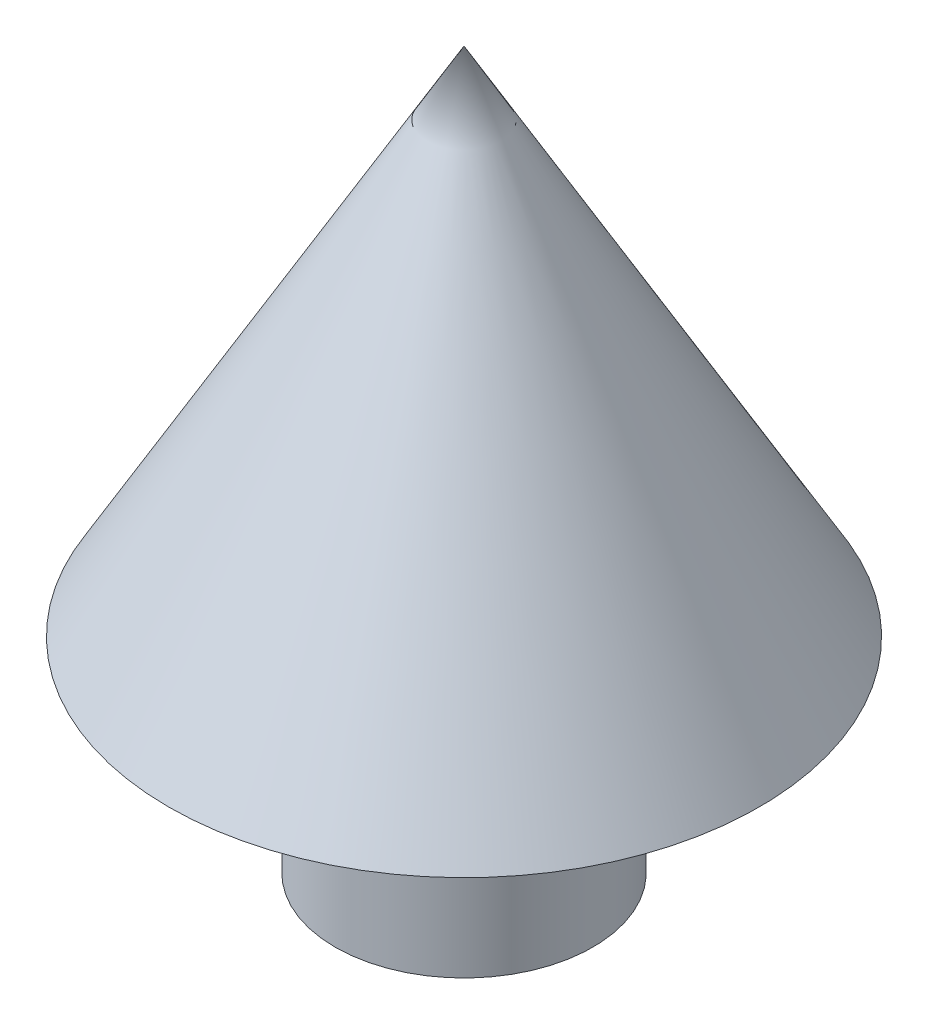
ISO-10303-21;
HEADER;
FILE_DESCRIPTION(('STEP AP214'),'2;1');
FILE_NAME('part.step','',(''),(''),'','','');
FILE_SCHEMA(('AUTOMOTIVE_DESIGN { 1 0 10303 214 1 1 1 1 }'));
ENDSEC;
DATA;
#1=APPLICATION_CONTEXT('core data for automotive mechanical design processes');
#2=APPLICATION_PROTOCOL_DEFINITION('international standard','automotive_design',2000,#1);
#3=PRODUCT_CONTEXT('',#1,'mechanical');
#4=PRODUCT('Part','Part','',(#3));
#5=PRODUCT_RELATED_PRODUCT_CATEGORY('part','',(#4));
#6=PRODUCT_DEFINITION_FORMATION('','',#4);
#7=PRODUCT_DEFINITION_CONTEXT('part definition',#1,'design');
#8=PRODUCT_DEFINITION('design','',#6,#7);
#9=PRODUCT_DEFINITION_SHAPE('','',#8);
#10=(LENGTH_UNIT() NAMED_UNIT(*) SI_UNIT(.MILLI.,.METRE.));
#11=(NAMED_UNIT(*) PLANE_ANGLE_UNIT() SI_UNIT($,.RADIAN.));
#12=(NAMED_UNIT(*) SI_UNIT($,.STERADIAN.) SOLID_ANGLE_UNIT());
#13=UNCERTAINTY_MEASURE_WITH_UNIT(LENGTH_MEASURE(1.E-05),#10,'distance_accuracy_value','');
#14=(GEOMETRIC_REPRESENTATION_CONTEXT(3) GLOBAL_UNCERTAINTY_ASSIGNED_CONTEXT((#13)) GLOBAL_UNIT_ASSIGNED_CONTEXT((#10,
#11,#12)) REPRESENTATION_CONTEXT('',''));
#15=CARTESIAN_POINT('',(0.,0.,0.));
#16=DIRECTION('',(0.,0.,1.));
#17=DIRECTION('',(1.,0.,0.));
#18=AXIS2_PLACEMENT_3D('',#15,#16,#17);
#19=CARTESIAN_POINT('',(0.,0.,6.3));
#20=DIRECTION('',(0.,1.,0.));
#21=DIRECTION('',(0.,0.,1.));
#22=AXIS2_PLACEMENT_3D('',#19,#20,#21);
#23=PLANE('',#22);
#24=CARTESIAN_POINT('',(0.,0.,0.));
#25=DIRECTION('',(0.,-1.,0.));
#26=DIRECTION('',(0.,0.,-1.));
#27=AXIS2_PLACEMENT_3D('',#24,#25,#26);
#28=CIRCLE('',#27,6.3);
#29=CARTESIAN_POINT('',(0.,0.,-6.3));
#30=VERTEX_POINT('',#29);
#31=EDGE_CURVE('E70',#30,#30,#28,.T.);
#32=ORIENTED_EDGE('',*,*,#31,.T.);
#33=EDGE_LOOP('',(#32));
#34=FACE_BOUND('',#33,.T.);
#35=ADVANCED_FACE('F39',(#34),#23,.F.);
#36=CARTESIAN_POINT('',(0.,35.,0.));
#37=DIRECTION('',(0.,-1.,0.));
#38=DIRECTION('',(0.,0.,-1.));
#39=AXIS2_PLACEMENT_3D('',#36,#37,#38);
#40=CONICAL_SURFACE('',#39,0.,0.523598775598293);
#41=CARTESIAN_POINT('',(0.,10.,0.));
#42=DIRECTION('',(0.,-1.,0.));
#43=DIRECTION('',(0.,0.,-1.));
#44=AXIS2_PLACEMENT_3D('',#41,#42,#43);
#45=CIRCLE('',#44,14.4337567297404);
#46=CARTESIAN_POINT('',(0.,10.,-14.4337567297404));
#47=VERTEX_POINT('',#46);
#48=EDGE_CURVE('E11',#47,#47,#45,.T.);
#49=ORIENTED_EDGE('',*,*,#48,.F.);
#50=EDGE_LOOP('',(#49));
#51=FACE_BOUND('',#50,.T.);
#52=CARTESIAN_POINT('',(0.,35.,0.));
#53=VERTEX_POINT('',#52);
#54=VERTEX_LOOP('',#53);
#55=FACE_BOUND('',#54,.T.);
#56=ADVANCED_FACE('F49',(#51,#55),#40,.T.);
#57=CARTESIAN_POINT('',(0.,10.,14.4337567297404));
#58=DIRECTION('',(0.,1.,0.));
#59=DIRECTION('',(0.,0.,1.));
#60=AXIS2_PLACEMENT_3D('',#57,#58,#59);
#61=PLANE('',#60);
#62=CARTESIAN_POINT('',(0.,10.,0.));
#63=DIRECTION('',(0.,-1.,0.));
#64=DIRECTION('',(0.,0.,-1.));
#65=AXIS2_PLACEMENT_3D('',#62,#63,#64);
#66=CIRCLE('',#65,6.3);
#67=CARTESIAN_POINT('',(0.,10.,-6.3));
#68=VERTEX_POINT('',#67);
#69=EDGE_CURVE('E46',#68,#68,#66,.T.);
#70=ORIENTED_EDGE('',*,*,#69,.F.);
#71=EDGE_LOOP('',(#70));
#72=FACE_BOUND('',#71,.T.);
#73=ORIENTED_EDGE('',*,*,#48,.T.);
#74=EDGE_LOOP('',(#73));
#75=FACE_BOUND('',#74,.T.);
#76=ADVANCED_FACE('F51',(#72,#75),#61,.F.);
#77=CARTESIAN_POINT('',(0.,0.,0.));
#78=DIRECTION('',(0.,-1.,0.));
#79=DIRECTION('',(0.,0.,-1.));
#80=AXIS2_PLACEMENT_3D('',#77,#78,#79);
#81=CYLINDRICAL_SURFACE('',#80,6.3);
#82=ORIENTED_EDGE('',*,*,#31,.F.);
#83=EDGE_LOOP('',(#82));
#84=FACE_BOUND('',#83,.T.);
#85=ORIENTED_EDGE('',*,*,#69,.T.);
#86=EDGE_LOOP('',(#85));
#87=FACE_BOUND('',#86,.T.);
#88=ADVANCED_FACE('F57',(#84,#87),#81,.T.);
#89=CLOSED_SHELL('',(#35,#56,#76,#88));
#90=MANIFOLD_SOLID_BREP('B2',#89);
#91=ADVANCED_BREP_SHAPE_REPRESENTATION('',(#18,#90),#14);
#92=SHAPE_DEFINITION_REPRESENTATION(#9,#91);
ENDSEC;
END-ISO-10303-21;
